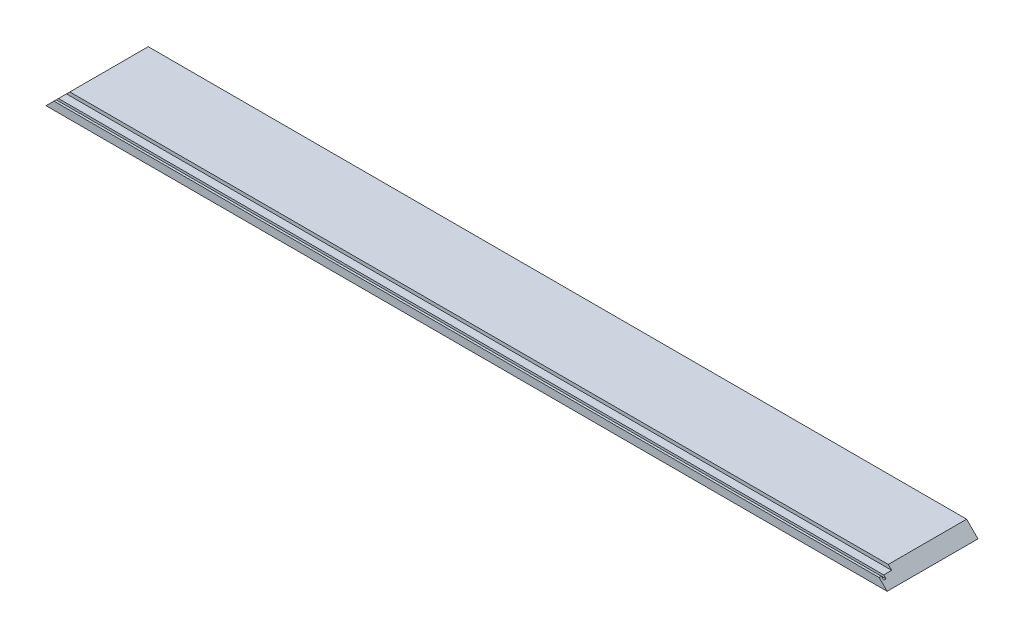
ISO-10303-21;
HEADER;
FILE_DESCRIPTION(('STEP AP214'),'2;1');
FILE_NAME('part.step','',(''),(''),'','','');
FILE_SCHEMA(('AUTOMOTIVE_DESIGN { 1 0 10303 214 1 1 1 1 }'));
ENDSEC;
DATA;
#1=APPLICATION_CONTEXT('core data for automotive mechanical design processes');
#2=APPLICATION_PROTOCOL_DEFINITION('international standard','automotive_design',2000,#1);
#3=PRODUCT_CONTEXT('',#1,'mechanical');
#4=PRODUCT('Part','Part','',(#3));
#5=PRODUCT_RELATED_PRODUCT_CATEGORY('part','',(#4));
#6=PRODUCT_DEFINITION_FORMATION('','',#4);
#7=PRODUCT_DEFINITION_CONTEXT('part definition',#1,'design');
#8=PRODUCT_DEFINITION('design','',#6,#7);
#9=PRODUCT_DEFINITION_SHAPE('','',#8);
#10=(LENGTH_UNIT() NAMED_UNIT(*) SI_UNIT(.MILLI.,.METRE.));
#11=(NAMED_UNIT(*) PLANE_ANGLE_UNIT() SI_UNIT($,.RADIAN.));
#12=(NAMED_UNIT(*) SI_UNIT($,.STERADIAN.) SOLID_ANGLE_UNIT());
#13=UNCERTAINTY_MEASURE_WITH_UNIT(LENGTH_MEASURE(1.E-05),#10,'distance_accuracy_value','');
#14=(GEOMETRIC_REPRESENTATION_CONTEXT(3) GLOBAL_UNCERTAINTY_ASSIGNED_CONTEXT((#13)) GLOBAL_UNIT_ASSIGNED_CONTEXT((#10,
#11,#12)) REPRESENTATION_CONTEXT('',''));
#15=CARTESIAN_POINT('',(0.,0.,0.));
#16=DIRECTION('',(0.,0.,1.));
#17=DIRECTION('',(1.,0.,0.));
#18=AXIS2_PLACEMENT_3D('',#15,#16,#17);
#19=CARTESIAN_POINT('',(370.25,7.,40.));
#20=DIRECTION('',(0.,-1.,0.));
#21=DIRECTION('',(0.,0.,-1.));
#22=AXIS2_PLACEMENT_3D('',#19,#20,#21);
#23=PLANE('',#22);
#24=DIRECTION('',(-1.,0.,0.));
#25=VECTOR('',#24,1.);
#26=CARTESIAN_POINT('',(370.25,7.,38.));
#27=LINE('',#26,#25);
#28=CARTESIAN_POINT('',(363.25,7.,38.));
#29=VERTEX_POINT('',#28);
#30=CARTESIAN_POINT('',(-363.25,7.00000000000001,38.));
#31=VERTEX_POINT('',#30);
#32=EDGE_CURVE('E155',#29,#31,#27,.T.);
#33=ORIENTED_EDGE('',*,*,#32,.T.);
#34=DIRECTION('',(0.,0.,1.));
#35=VECTOR('',#34,1.);
#36=CARTESIAN_POINT('',(-363.25,7.,40.0000000000001));
#37=LINE('',#36,#35);
#38=CARTESIAN_POINT('',(-363.25,6.99999999999999,40.));
#39=VERTEX_POINT('',#38);
#40=EDGE_CURVE('E181',#31,#39,#37,.T.);
#41=ORIENTED_EDGE('',*,*,#40,.T.);
#42=DIRECTION('',(-1.,0.,0.));
#43=VECTOR('',#42,1.);
#44=CARTESIAN_POINT('',(370.25,7.,40.));
#45=LINE('',#44,#43);
#46=CARTESIAN_POINT('',(363.25,6.99999999999991,40.));
#47=VERTEX_POINT('',#46);
#48=EDGE_CURVE('E130',#47,#39,#45,.T.);
#49=ORIENTED_EDGE('',*,*,#48,.F.);
#50=DIRECTION('',(0.,0.,-1.));
#51=VECTOR('',#50,1.);
#52=CARTESIAN_POINT('',(363.25,7.,40.));
#53=LINE('',#52,#51);
#54=EDGE_CURVE('E191',#47,#29,#53,.T.);
#55=ORIENTED_EDGE('',*,*,#54,.T.);
#56=EDGE_LOOP('',(#33,#41,#49,#55));
#57=FACE_BOUND('',#56,.T.);
#58=ADVANCED_FACE('F35',(#57),#23,.F.);
#59=CARTESIAN_POINT('',(-370.25,10.,-40.));
#60=DIRECTION('',(0.,0.,1.));
#61=DIRECTION('',(1.,0.,0.));
#62=AXIS2_PLACEMENT_3D('',#59,#60,#61);
#63=PLANE('',#62);
#64=DIRECTION('',(-1.,0.,0.));
#65=VECTOR('',#64,1.);
#66=CARTESIAN_POINT('',(-370.25,0.,-40.));
#67=LINE('',#66,#65);
#68=CARTESIAN_POINT('',(370.25,0.,-40.));
#69=VERTEX_POINT('',#68);
#70=CARTESIAN_POINT('',(-370.25,0.,-40.));
#71=VERTEX_POINT('',#70);
#72=EDGE_CURVE('E121',#69,#71,#67,.T.);
#73=ORIENTED_EDGE('',*,*,#72,.T.);
#74=DIRECTION('',(-0.707106781186552,-0.707106781186543,0.));
#75=VECTOR('',#74,1.);
#76=CARTESIAN_POINT('',(-370.25,0.,-40.));
#77=LINE('',#76,#75);
#78=CARTESIAN_POINT('',(-360.25,10.,-40.));
#79=VERTEX_POINT('',#78);
#80=EDGE_CURVE('E115',#79,#71,#77,.T.);
#81=ORIENTED_EDGE('',*,*,#80,.F.);
#82=DIRECTION('',(-1.,0.,0.));
#83=VECTOR('',#82,1.);
#84=CARTESIAN_POINT('',(-370.25,10.,-40.));
#85=LINE('',#84,#83);
#86=CARTESIAN_POINT('',(360.25,10.,-40.));
#87=VERTEX_POINT('',#86);
#88=EDGE_CURVE('E135',#87,#79,#85,.T.);
#89=ORIENTED_EDGE('',*,*,#88,.F.);
#90=DIRECTION('',(-0.707106781186552,0.707106781186543,0.));
#91=VECTOR('',#90,1.);
#92=CARTESIAN_POINT('',(370.25,0.,-40.));
#93=LINE('',#92,#91);
#94=EDGE_CURVE('E173',#69,#87,#93,.T.);
#95=ORIENTED_EDGE('',*,*,#94,.F.);
#96=EDGE_LOOP('',(#73,#81,#89,#95));
#97=FACE_BOUND('',#96,.T.);
#98=ADVANCED_FACE('F37',(#97),#63,.F.);
#99=CARTESIAN_POINT('',(-370.25,10.,40.));
#100=DIRECTION('',(0.,0.,-1.));
#101=DIRECTION('',(-1.,0.,0.));
#102=AXIS2_PLACEMENT_3D('',#99,#100,#101);
#103=PLANE('',#102);
#104=ORIENTED_EDGE('',*,*,#48,.T.);
#105=DIRECTION('',(-0.707106781186552,-0.707106781186543,0.));
#106=VECTOR('',#105,1.);
#107=CARTESIAN_POINT('',(-370.25,0.,40.));
#108=LINE('',#107,#106);
#109=CARTESIAN_POINT('',(-370.25,0.,40.));
#110=VERTEX_POINT('',#109);
#111=EDGE_CURVE('E112',#39,#110,#108,.T.);
#112=ORIENTED_EDGE('',*,*,#111,.T.);
#113=DIRECTION('',(1.,0.,0.));
#114=VECTOR('',#113,1.);
#115=CARTESIAN_POINT('',(-370.25,0.,40.));
#116=LINE('',#115,#114);
#117=CARTESIAN_POINT('',(370.25,0.,40.));
#118=VERTEX_POINT('',#117);
#119=EDGE_CURVE('E120',#110,#118,#116,.T.);
#120=ORIENTED_EDGE('',*,*,#119,.T.);
#121=DIRECTION('',(-0.707106781186552,0.707106781186543,0.));
#122=VECTOR('',#121,1.);
#123=CARTESIAN_POINT('',(370.25,0.,40.));
#124=LINE('',#123,#122);
#125=EDGE_CURVE('E175',#118,#47,#124,.T.);
#126=ORIENTED_EDGE('',*,*,#125,.T.);
#127=EDGE_LOOP('',(#104,#112,#120,#126));
#128=FACE_BOUND('',#127,.T.);
#129=ADVANCED_FACE('F126',(#128),#103,.F.);
#130=CARTESIAN_POINT('',(0.,10.,0.));
#131=DIRECTION('',(0.,1.,0.));
#132=DIRECTION('',(0.,0.,1.));
#133=AXIS2_PLACEMENT_3D('',#130,#131,#132);
#134=PLANE('',#133);
#135=DIRECTION('',(0.,0.,-1.));
#136=VECTOR('',#135,1.);
#137=CARTESIAN_POINT('',(-360.25,10.,40.));
#138=LINE('',#137,#136);
#139=CARTESIAN_POINT('',(-360.25,10.,29.));
#140=VERTEX_POINT('',#139);
#141=EDGE_CURVE('E131',#140,#79,#138,.T.);
#142=ORIENTED_EDGE('',*,*,#141,.F.);
#143=DIRECTION('',(-1.,0.,0.));
#144=VECTOR('',#143,1.);
#145=CARTESIAN_POINT('',(370.25,10.,29.));
#146=LINE('',#145,#144);
#147=CARTESIAN_POINT('',(360.25,10.,29.));
#148=VERTEX_POINT('',#147);
#149=EDGE_CURVE('E167',#148,#140,#146,.T.);
#150=ORIENTED_EDGE('',*,*,#149,.F.);
#151=DIRECTION('',(0.,0.,-1.));
#152=VECTOR('',#151,1.);
#153=CARTESIAN_POINT('',(360.25,10.,40.));
#154=LINE('',#153,#152);
#155=EDGE_CURVE('E178',#148,#87,#154,.T.);
#156=ORIENTED_EDGE('',*,*,#155,.T.);
#157=ORIENTED_EDGE('',*,*,#88,.T.);
#158=EDGE_LOOP('',(#142,#150,#156,#157));
#159=FACE_BOUND('',#158,.T.);
#160=ADVANCED_FACE('F235',(#159),#134,.T.);
#161=CARTESIAN_POINT('',(0.,0.,0.));
#162=DIRECTION('',(0.,1.,0.));
#163=DIRECTION('',(0.,0.,1.));
#164=AXIS2_PLACEMENT_3D('',#161,#162,#163);
#165=PLANE('',#164);
#166=DIRECTION('',(0.,0.,-1.));
#167=VECTOR('',#166,1.);
#168=CARTESIAN_POINT('',(370.25,0.,-40.));
#169=LINE('',#168,#167);
#170=EDGE_CURVE('E134',#118,#69,#169,.T.);
#171=ORIENTED_EDGE('',*,*,#170,.F.);
#172=ORIENTED_EDGE('',*,*,#119,.F.);
#173=DIRECTION('',(0.,0.,1.));
#174=VECTOR('',#173,1.);
#175=CARTESIAN_POINT('',(-370.25,0.,-40.));
#176=LINE('',#175,#174);
#177=EDGE_CURVE('E109',#71,#110,#176,.T.);
#178=ORIENTED_EDGE('',*,*,#177,.F.);
#179=ORIENTED_EDGE('',*,*,#72,.F.);
#180=EDGE_LOOP('',(#171,#172,#178,#179));
#181=FACE_BOUND('',#180,.T.);
#182=ADVANCED_FACE('F133',(#181),#165,.F.);
#183=DIRECTION('',(-1.,0.,0.));
#184=VECTOR('',#183,1.);
#185=CARTESIAN_POINT('',(370.25,7.,29.));
#186=LINE('',#185,#184);
#187=CARTESIAN_POINT('',(363.25,7.,29.));
#188=VERTEX_POINT('',#187);
#189=CARTESIAN_POINT('',(-363.25,7.,29.));
#190=VERTEX_POINT('',#189);
#191=EDGE_CURVE('E165',#188,#190,#186,.T.);
#192=ORIENTED_EDGE('',*,*,#191,.T.);
#193=DIRECTION('',(0.,0.,1.));
#194=VECTOR('',#193,1.);
#195=CARTESIAN_POINT('',(-363.25,7.,40.0000000000001));
#196=LINE('',#195,#194);
#197=CARTESIAN_POINT('',(-363.25,7.00000000000001,36.));
#198=VERTEX_POINT('',#197);
#199=EDGE_CURVE('E154',#190,#198,#196,.T.);
#200=ORIENTED_EDGE('',*,*,#199,.T.);
#201=DIRECTION('',(-1.,0.,0.));
#202=VECTOR('',#201,1.);
#203=CARTESIAN_POINT('',(370.25,7.,36.));
#204=LINE('',#203,#202);
#205=CARTESIAN_POINT('',(363.25,6.99999999999999,36.));
#206=VERTEX_POINT('',#205);
#207=EDGE_CURVE('E145',#206,#198,#204,.T.);
#208=ORIENTED_EDGE('',*,*,#207,.F.);
#209=DIRECTION('',(0.,0.,-1.));
#210=VECTOR('',#209,1.);
#211=CARTESIAN_POINT('',(363.25,7.,40.));
#212=LINE('',#211,#210);
#213=EDGE_CURVE('E57',#206,#188,#212,.T.);
#214=ORIENTED_EDGE('',*,*,#213,.T.);
#215=EDGE_LOOP('',(#192,#200,#208,#214));
#216=FACE_BOUND('',#215,.T.);
#217=ADVANCED_FACE('F152',(#216),#23,.F.);
#218=CARTESIAN_POINT('',(370.25,10.,29.));
#219=DIRECTION('',(0.,0.,-1.));
#220=DIRECTION('',(0.,1.,0.));
#221=AXIS2_PLACEMENT_3D('',#218,#219,#220);
#222=PLANE('',#221);
#223=ORIENTED_EDGE('',*,*,#149,.T.);
#224=DIRECTION('',(-0.707106781186552,-0.707106781186543,0.));
#225=VECTOR('',#224,1.);
#226=CARTESIAN_POINT('',(5.00000000000445,375.25,28.9999999999992));
#227=LINE('',#226,#225);
#228=EDGE_CURVE('E176',#140,#190,#227,.T.);
#229=ORIENTED_EDGE('',*,*,#228,.T.);
#230=ORIENTED_EDGE('',*,*,#191,.F.);
#231=DIRECTION('',(-0.707106781186552,0.707106781186543,0.));
#232=VECTOR('',#231,1.);
#233=CARTESIAN_POINT('',(365.25,4.99999999999994,29.));
#234=LINE('',#233,#232);
#235=EDGE_CURVE('E160',#188,#148,#234,.T.);
#236=ORIENTED_EDGE('',*,*,#235,.T.);
#237=EDGE_LOOP('',(#223,#229,#230,#236));
#238=FACE_BOUND('',#237,.T.);
#239=ADVANCED_FACE('F229',(#238),#222,.F.);
#240=CARTESIAN_POINT('',(370.25,7.,38.));
#241=DIRECTION('',(0.,0.,1.));
#242=DIRECTION('',(0.,-1.,0.));
#243=AXIS2_PLACEMENT_3D('',#240,#241,#242);
#244=PLANE('',#243);
#245=DIRECTION('',(-1.,0.,0.));
#246=VECTOR('',#245,1.);
#247=CARTESIAN_POINT('',(370.25,5.,38.));
#248=LINE('',#247,#246);
#249=CARTESIAN_POINT('',(365.25,5.,38.));
#250=VERTEX_POINT('',#249);
#251=CARTESIAN_POINT('',(-365.25,5.,38.));
#252=VERTEX_POINT('',#251);
#253=EDGE_CURVE('E157',#250,#252,#248,.T.);
#254=ORIENTED_EDGE('',*,*,#253,.T.);
#255=DIRECTION('',(0.707106781186552,0.707106781186543,0.));
#256=VECTOR('',#255,1.);
#257=CARTESIAN_POINT('',(3.50000000000444,373.75,37.9999999999987));
#258=LINE('',#257,#256);
#259=EDGE_CURVE('E201',#252,#31,#258,.T.);
#260=ORIENTED_EDGE('',*,*,#259,.T.);
#261=ORIENTED_EDGE('',*,*,#32,.F.);
#262=DIRECTION('',(0.707106781186552,-0.707106781186543,0.));
#263=VECTOR('',#262,1.);
#264=CARTESIAN_POINT('',(366.75,3.49999999999996,38.));
#265=LINE('',#264,#263);
#266=EDGE_CURVE('E187',#29,#250,#265,.T.);
#267=ORIENTED_EDGE('',*,*,#266,.T.);
#268=EDGE_LOOP('',(#254,#260,#261,#267));
#269=FACE_BOUND('',#268,.T.);
#270=ADVANCED_FACE('F199',(#269),#244,.F.);
#271=CARTESIAN_POINT('',(370.25,5.,38.));
#272=DIRECTION('',(0.,-1.,0.));
#273=DIRECTION('',(0.,0.,-1.));
#274=AXIS2_PLACEMENT_3D('',#271,#272,#273);
#275=PLANE('',#274);
#276=DIRECTION('',(-1.,0.,0.));
#277=VECTOR('',#276,1.);
#278=CARTESIAN_POINT('',(370.25,5.,36.));
#279=LINE('',#278,#277);
#280=CARTESIAN_POINT('',(365.25,5.,36.));
#281=VERTEX_POINT('',#280);
#282=CARTESIAN_POINT('',(-365.25,5.00000000000003,36.));
#283=VERTEX_POINT('',#282);
#284=EDGE_CURVE('E147',#281,#283,#279,.T.);
#285=ORIENTED_EDGE('',*,*,#284,.T.);
#286=DIRECTION('',(0.,0.,1.));
#287=VECTOR('',#286,1.);
#288=CARTESIAN_POINT('',(-365.25,5.,37.9999999999997));
#289=LINE('',#288,#287);
#290=EDGE_CURVE('E50',#283,#252,#289,.T.);
#291=ORIENTED_EDGE('',*,*,#290,.T.);
#292=ORIENTED_EDGE('',*,*,#253,.F.);
#293=DIRECTION('',(0.,0.,-1.));
#294=VECTOR('',#293,1.);
#295=CARTESIAN_POINT('',(365.25,5.,38.));
#296=LINE('',#295,#294);
#297=EDGE_CURVE('E185',#250,#281,#296,.T.);
#298=ORIENTED_EDGE('',*,*,#297,.T.);
#299=EDGE_LOOP('',(#285,#291,#292,#298));
#300=FACE_BOUND('',#299,.T.);
#301=ADVANCED_FACE('F203',(#300),#275,.F.);
#302=CARTESIAN_POINT('',(370.25,7.,36.));
#303=DIRECTION('',(0.,0.,-1.));
#304=DIRECTION('',(-1.,0.,0.));
#305=AXIS2_PLACEMENT_3D('',#302,#303,#304);
#306=PLANE('',#305);
#307=ORIENTED_EDGE('',*,*,#207,.T.);
#308=DIRECTION('',(-0.707106781186552,-0.707106781186543,0.));
#309=VECTOR('',#308,1.);
#310=CARTESIAN_POINT('',(3.50000000000444,373.75,36.));
#311=LINE('',#310,#309);
#312=EDGE_CURVE('E11',#198,#283,#311,.T.);
#313=ORIENTED_EDGE('',*,*,#312,.T.);
#314=ORIENTED_EDGE('',*,*,#284,.F.);
#315=DIRECTION('',(-0.707106781186552,0.707106781186543,0.));
#316=VECTOR('',#315,1.);
#317=CARTESIAN_POINT('',(366.75,3.49999999999996,36.));
#318=LINE('',#317,#316);
#319=EDGE_CURVE('E43',#281,#206,#318,.T.);
#320=ORIENTED_EDGE('',*,*,#319,.T.);
#321=EDGE_LOOP('',(#307,#313,#314,#320));
#322=FACE_BOUND('',#321,.T.);
#323=ADVANCED_FACE('F144',(#322),#306,.F.);
#324=CARTESIAN_POINT('',(370.25,0.,40.));
#325=DIRECTION('',(-0.707106781186543,-0.707106781186552,0.));
#326=DIRECTION('',(0.707106781186552,-0.707106781186543,0.));
#327=AXIS2_PLACEMENT_3D('',#324,#325,#326);
#328=PLANE('',#327);
#329=ORIENTED_EDGE('',*,*,#213,.F.);
#330=ORIENTED_EDGE('',*,*,#319,.F.);
#331=ORIENTED_EDGE('',*,*,#297,.F.);
#332=ORIENTED_EDGE('',*,*,#266,.F.);
#333=ORIENTED_EDGE('',*,*,#54,.F.);
#334=ORIENTED_EDGE('',*,*,#125,.F.);
#335=ORIENTED_EDGE('',*,*,#170,.T.);
#336=ORIENTED_EDGE('',*,*,#94,.T.);
#337=ORIENTED_EDGE('',*,*,#155,.F.);
#338=ORIENTED_EDGE('',*,*,#235,.F.);
#339=EDGE_LOOP('',(#329,#330,#331,#332,#333,#334,#335,#336,#337,#338));
#340=FACE_BOUND('',#339,.T.);
#341=ADVANCED_FACE('F211',(#340),#328,.F.);
#342=CARTESIAN_POINT('',(-370.25,0.,40.));
#343=DIRECTION('',(0.707106781186543,-0.707106781186552,0.));
#344=DIRECTION('',(0.707106781186552,0.707106781186543,0.));
#345=AXIS2_PLACEMENT_3D('',#342,#343,#344);
#346=PLANE('',#345);
#347=ORIENTED_EDGE('',*,*,#141,.T.);
#348=ORIENTED_EDGE('',*,*,#80,.T.);
#349=ORIENTED_EDGE('',*,*,#177,.T.);
#350=ORIENTED_EDGE('',*,*,#111,.F.);
#351=ORIENTED_EDGE('',*,*,#40,.F.);
#352=ORIENTED_EDGE('',*,*,#259,.F.);
#353=ORIENTED_EDGE('',*,*,#290,.F.);
#354=ORIENTED_EDGE('',*,*,#312,.F.);
#355=ORIENTED_EDGE('',*,*,#199,.F.);
#356=ORIENTED_EDGE('',*,*,#228,.F.);
#357=EDGE_LOOP('',(#347,#348,#349,#350,#351,#352,#353,#354,#355,#356));
#358=FACE_BOUND('',#357,.T.);
#359=ADVANCED_FACE('F111',(#358),#346,.F.);
#360=CLOSED_SHELL('',(#58,#98,#129,#160,#182,#217,#239,#270,#301,#323,#341,#359));
#361=MANIFOLD_SOLID_BREP('B2',#360);
#362=ADVANCED_BREP_SHAPE_REPRESENTATION('',(#18,#361),#14);
#363=SHAPE_DEFINITION_REPRESENTATION(#9,#362);
ENDSEC;
END-ISO-10303-21;
